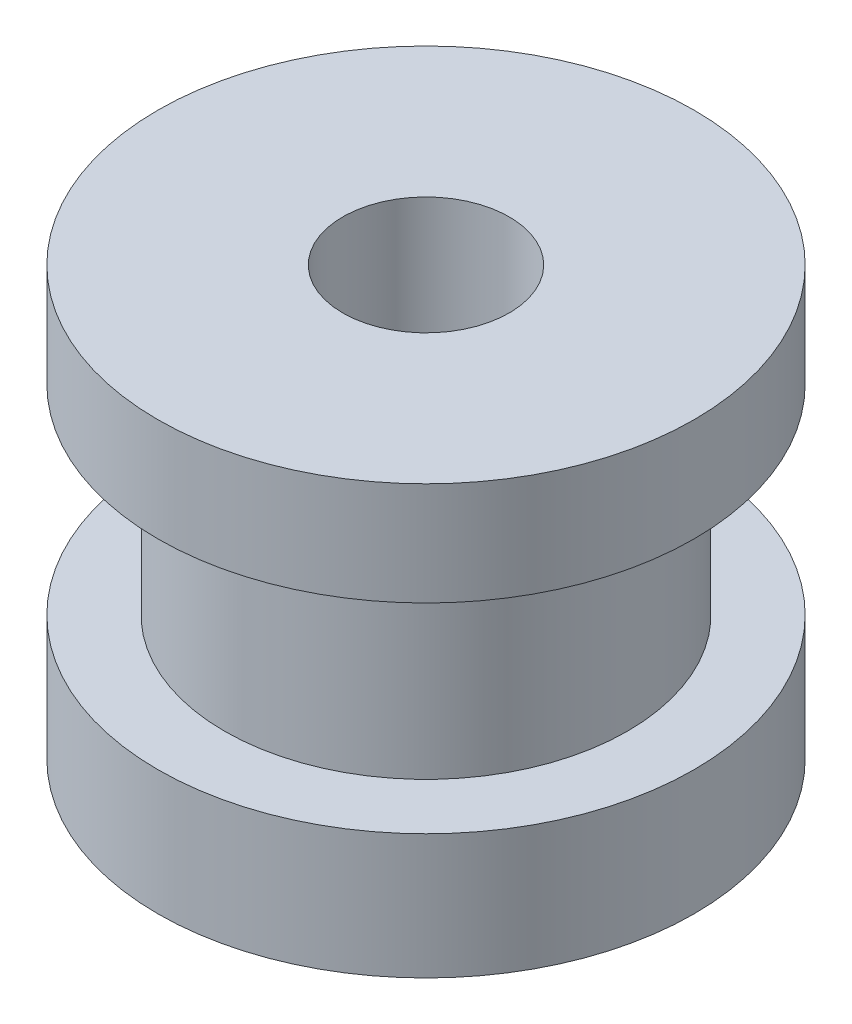
ISO-10303-21;
HEADER;
FILE_DESCRIPTION(('STEP AP214'),'2;1');
FILE_NAME('part.step','',(''),(''),'','','');
FILE_SCHEMA(('AUTOMOTIVE_DESIGN { 1 0 10303 214 1 1 1 1 }'));
ENDSEC;
DATA;
#1=APPLICATION_CONTEXT('core data for automotive mechanical design processes');
#2=APPLICATION_PROTOCOL_DEFINITION('international standard','automotive_design',2000,#1);
#3=PRODUCT_CONTEXT('',#1,'mechanical');
#4=PRODUCT('Part','Part','',(#3));
#5=PRODUCT_RELATED_PRODUCT_CATEGORY('part','',(#4));
#6=PRODUCT_DEFINITION_FORMATION('','',#4);
#7=PRODUCT_DEFINITION_CONTEXT('part definition',#1,'design');
#8=PRODUCT_DEFINITION('design','',#6,#7);
#9=PRODUCT_DEFINITION_SHAPE('','',#8);
#10=(LENGTH_UNIT() NAMED_UNIT(*) SI_UNIT(.MILLI.,.METRE.));
#11=(NAMED_UNIT(*) PLANE_ANGLE_UNIT() SI_UNIT($,.RADIAN.));
#12=(NAMED_UNIT(*) SI_UNIT($,.STERADIAN.) SOLID_ANGLE_UNIT());
#13=UNCERTAINTY_MEASURE_WITH_UNIT(LENGTH_MEASURE(1.E-05),#10,'distance_accuracy_value','');
#14=(GEOMETRIC_REPRESENTATION_CONTEXT(3) GLOBAL_UNCERTAINTY_ASSIGNED_CONTEXT((#13)) GLOBAL_UNIT_ASSIGNED_CONTEXT((#10,
#11,#12)) REPRESENTATION_CONTEXT('',''));
#15=CARTESIAN_POINT('',(0.,0.,0.));
#16=DIRECTION('',(0.,0.,1.));
#17=DIRECTION('',(1.,0.,0.));
#18=AXIS2_PLACEMENT_3D('',#15,#16,#17);
#19=CARTESIAN_POINT('',(0.,6.,0.));
#20=DIRECTION('',(0.,-1.,0.));
#21=DIRECTION('',(0.,0.,-1.));
#22=AXIS2_PLACEMENT_3D('',#19,#20,#21);
#23=CYLINDRICAL_SURFACE('',#22,2.1);
#24=CARTESIAN_POINT('',(0.,0.,0.));
#25=DIRECTION('',(0.,-1.,0.));
#26=DIRECTION('',(0.,0.,-1.));
#27=AXIS2_PLACEMENT_3D('',#24,#25,#26);
#28=CIRCLE('',#27,2.1);
#29=CARTESIAN_POINT('',(0.,0.,-2.1));
#30=VERTEX_POINT('',#29);
#31=EDGE_CURVE('E55',#30,#30,#28,.T.);
#32=ORIENTED_EDGE('',*,*,#31,.T.);
#33=EDGE_LOOP('',(#32));
#34=FACE_BOUND('',#33,.T.);
#35=CARTESIAN_POINT('',(0.,5.85,0.));
#36=DIRECTION('',(0.,1.,0.));
#37=DIRECTION('',(0.,0.,1.));
#38=AXIS2_PLACEMENT_3D('',#35,#36,#37);
#39=CIRCLE('',#38,2.1);
#40=CARTESIAN_POINT('',(0.,5.85,2.1));
#41=VERTEX_POINT('',#40);
#42=EDGE_CURVE('E35',#41,#41,#39,.F.);
#43=ORIENTED_EDGE('',*,*,#42,.F.);
#44=EDGE_LOOP('',(#43));
#45=FACE_BOUND('',#44,.T.);
#46=ADVANCED_FACE('F31',(#34,#45),#23,.F.);
#47=CARTESIAN_POINT('',(0.,3.75,0.));
#48=DIRECTION('',(0.,1.,0.));
#49=DIRECTION('',(0.,0.,1.));
#50=AXIS2_PLACEMENT_3D('',#47,#48,#49);
#51=PLANE('',#50);
#52=CARTESIAN_POINT('',(0.,3.75,0.));
#53=DIRECTION('',(0.,1.,0.));
#54=DIRECTION('',(0.,0.,1.));
#55=AXIS2_PLACEMENT_3D('',#52,#53,#54);
#56=CIRCLE('',#55,8.05);
#57=CARTESIAN_POINT('',(0.,3.75,8.05));
#58=VERTEX_POINT('',#57);
#59=EDGE_CURVE('E10',#58,#58,#56,.T.);
#60=ORIENTED_EDGE('',*,*,#59,.T.);
#61=EDGE_LOOP('',(#60));
#62=FACE_BOUND('',#61,.T.);
#63=CARTESIAN_POINT('',(0.,3.75,0.));
#64=DIRECTION('',(0.,1.,0.));
#65=DIRECTION('',(0.,0.,1.));
#66=AXIS2_PLACEMENT_3D('',#63,#64,#65);
#67=CIRCLE('',#66,6.05);
#68=CARTESIAN_POINT('',(0.,3.75,6.05));
#69=VERTEX_POINT('',#68);
#70=EDGE_CURVE('E46',#69,#69,#67,.T.);
#71=ORIENTED_EDGE('',*,*,#70,.F.);
#72=EDGE_LOOP('',(#71));
#73=FACE_BOUND('',#72,.T.);
#74=ADVANCED_FACE('F73',(#62,#73),#51,.T.);
#75=CARTESIAN_POINT('',(0.,3.75,0.));
#76=DIRECTION('',(0.,-1.,0.));
#77=DIRECTION('',(0.,0.,-1.));
#78=AXIS2_PLACEMENT_3D('',#75,#76,#77);
#79=CYLINDRICAL_SURFACE('',#78,8.05);
#80=ORIENTED_EDGE('',*,*,#59,.F.);
#81=EDGE_LOOP('',(#80));
#82=FACE_BOUND('',#81,.T.);
#83=CARTESIAN_POINT('',(0.,0.,0.));
#84=DIRECTION('',(0.,1.,0.));
#85=DIRECTION('',(0.,0.,1.));
#86=AXIS2_PLACEMENT_3D('',#83,#84,#85);
#87=CIRCLE('',#86,8.05);
#88=CARTESIAN_POINT('',(0.,0.,8.05));
#89=VERTEX_POINT('',#88);
#90=EDGE_CURVE('E39',#89,#89,#87,.T.);
#91=ORIENTED_EDGE('',*,*,#90,.T.);
#92=EDGE_LOOP('',(#91));
#93=FACE_BOUND('',#92,.T.);
#94=ADVANCED_FACE('F33',(#82,#93),#79,.T.);
#95=CARTESIAN_POINT('',(0.,0.,0.));
#96=DIRECTION('',(0.,1.,0.));
#97=DIRECTION('',(0.,0.,1.));
#98=AXIS2_PLACEMENT_3D('',#95,#96,#97);
#99=PLANE('',#98);
#100=ORIENTED_EDGE('',*,*,#31,.F.);
#101=EDGE_LOOP('',(#100));
#102=FACE_BOUND('',#101,.T.);
#103=ORIENTED_EDGE('',*,*,#90,.F.);
#104=EDGE_LOOP('',(#103));
#105=FACE_BOUND('',#104,.T.);
#106=ADVANCED_FACE('F98',(#102,#105),#99,.F.);
#107=CARTESIAN_POINT('',(0.,9.75,0.));
#108=DIRECTION('',(0.,-1.,0.));
#109=DIRECTION('',(0.,0.,-1.));
#110=AXIS2_PLACEMENT_3D('',#107,#108,#109);
#111=CYLINDRICAL_SURFACE('',#110,6.05);
#112=CARTESIAN_POINT('',(0.,9.75,0.));
#113=DIRECTION('',(0.,1.,0.));
#114=DIRECTION('',(0.,0.,1.));
#115=AXIS2_PLACEMENT_3D('',#112,#113,#114);
#116=CIRCLE('',#115,6.05);
#117=CARTESIAN_POINT('',(0.,9.75,6.05));
#118=VERTEX_POINT('',#117);
#119=EDGE_CURVE('E44',#118,#118,#116,.T.);
#120=ORIENTED_EDGE('',*,*,#119,.F.);
#121=EDGE_LOOP('',(#120));
#122=FACE_BOUND('',#121,.T.);
#123=ORIENTED_EDGE('',*,*,#70,.T.);
#124=EDGE_LOOP('',(#123));
#125=FACE_BOUND('',#124,.T.);
#126=ADVANCED_FACE('F92',(#122,#125),#111,.T.);
#127=CARTESIAN_POINT('',(0.,9.75,0.));
#128=DIRECTION('',(0.,1.,0.));
#129=DIRECTION('',(0.,0.,1.));
#130=AXIS2_PLACEMENT_3D('',#127,#128,#129);
#131=PLANE('',#130);
#132=CARTESIAN_POINT('',(0.,9.75,0.));
#133=DIRECTION('',(0.,1.,0.));
#134=DIRECTION('',(0.,0.,1.));
#135=AXIS2_PLACEMENT_3D('',#132,#133,#134);
#136=CIRCLE('',#135,8.05);
#137=CARTESIAN_POINT('',(0.,9.75,8.05));
#138=VERTEX_POINT('',#137);
#139=EDGE_CURVE('E52',#138,#138,#136,.T.);
#140=ORIENTED_EDGE('',*,*,#139,.F.);
#141=EDGE_LOOP('',(#140));
#142=FACE_BOUND('',#141,.T.);
#143=ORIENTED_EDGE('',*,*,#119,.T.);
#144=EDGE_LOOP('',(#143));
#145=FACE_BOUND('',#144,.T.);
#146=ADVANCED_FACE('F89',(#142,#145),#131,.F.);
#147=CARTESIAN_POINT('',(0.,12.85,0.));
#148=DIRECTION('',(0.,-1.,0.));
#149=DIRECTION('',(0.,0.,-1.));
#150=AXIS2_PLACEMENT_3D('',#147,#148,#149);
#151=CYLINDRICAL_SURFACE('',#150,8.05);
#152=CARTESIAN_POINT('',(0.,12.85,0.));
#153=DIRECTION('',(0.,1.,0.));
#154=DIRECTION('',(0.,0.,1.));
#155=AXIS2_PLACEMENT_3D('',#152,#153,#154);
#156=CIRCLE('',#155,8.05);
#157=CARTESIAN_POINT('',(0.,12.85,8.05));
#158=VERTEX_POINT('',#157);
#159=EDGE_CURVE('E49',#158,#158,#156,.T.);
#160=ORIENTED_EDGE('',*,*,#159,.F.);
#161=EDGE_LOOP('',(#160));
#162=FACE_BOUND('',#161,.T.);
#163=ORIENTED_EDGE('',*,*,#139,.T.);
#164=EDGE_LOOP('',(#163));
#165=FACE_BOUND('',#164,.T.);
#166=ADVANCED_FACE('F87',(#162,#165),#151,.T.);
#167=CARTESIAN_POINT('',(0.,12.85,0.));
#168=DIRECTION('',(0.,1.,0.));
#169=DIRECTION('',(0.,0.,1.));
#170=AXIS2_PLACEMENT_3D('',#167,#168,#169);
#171=PLANE('',#170);
#172=CARTESIAN_POINT('',(0.,12.85,0.));
#173=DIRECTION('',(0.,1.,0.));
#174=DIRECTION('',(0.,0.,1.));
#175=AXIS2_PLACEMENT_3D('',#172,#173,#174);
#176=CIRCLE('',#175,2.5);
#177=CARTESIAN_POINT('',(0.,12.85,2.5));
#178=VERTEX_POINT('',#177);
#179=EDGE_CURVE('E60',#178,#178,#176,.T.);
#180=ORIENTED_EDGE('',*,*,#179,.F.);
#181=EDGE_LOOP('',(#180));
#182=FACE_BOUND('',#181,.T.);
#183=ORIENTED_EDGE('',*,*,#159,.T.);
#184=EDGE_LOOP('',(#183));
#185=FACE_BOUND('',#184,.T.);
#186=ADVANCED_FACE('F84',(#182,#185),#171,.T.);
#187=CARTESIAN_POINT('',(0.,5.85,0.));
#188=DIRECTION('',(0.,1.,0.));
#189=DIRECTION('',(0.,0.,1.));
#190=AXIS2_PLACEMENT_3D('',#187,#188,#189);
#191=PLANE('',#190);
#192=CARTESIAN_POINT('',(0.,5.85,0.));
#193=DIRECTION('',(0.,1.,0.));
#194=DIRECTION('',(0.,0.,1.));
#195=AXIS2_PLACEMENT_3D('',#192,#193,#194);
#196=CIRCLE('',#195,2.5);
#197=CARTESIAN_POINT('',(0.,5.85,2.5));
#198=VERTEX_POINT('',#197);
#199=EDGE_CURVE('E63',#198,#198,#196,.T.);
#200=ORIENTED_EDGE('',*,*,#199,.T.);
#201=EDGE_LOOP('',(#200));
#202=FACE_BOUND('',#201,.T.);
#203=ORIENTED_EDGE('',*,*,#42,.T.);
#204=EDGE_LOOP('',(#203));
#205=FACE_BOUND('',#204,.T.);
#206=ADVANCED_FACE('F70',(#202,#205),#191,.T.);
#207=CARTESIAN_POINT('',(0.,5.85,0.));
#208=DIRECTION('',(0.,1.,0.));
#209=DIRECTION('',(0.,0.,1.));
#210=AXIS2_PLACEMENT_3D('',#207,#208,#209);
#211=CYLINDRICAL_SURFACE('',#210,2.5);
#212=ORIENTED_EDGE('',*,*,#199,.F.);
#213=EDGE_LOOP('',(#212));
#214=FACE_BOUND('',#213,.T.);
#215=ORIENTED_EDGE('',*,*,#179,.T.);
#216=EDGE_LOOP('',(#215));
#217=FACE_BOUND('',#216,.T.);
#218=ADVANCED_FACE('F82',(#214,#217),#211,.F.);
#219=CLOSED_SHELL('',(#46,#74,#94,#106,#126,#146,#166,#186,#206,#218));
#220=MANIFOLD_SOLID_BREP('B2',#219);
#221=ADVANCED_BREP_SHAPE_REPRESENTATION('',(#18,#220),#14);
#222=SHAPE_DEFINITION_REPRESENTATION(#9,#221);
ENDSEC;
END-ISO-10303-21;
